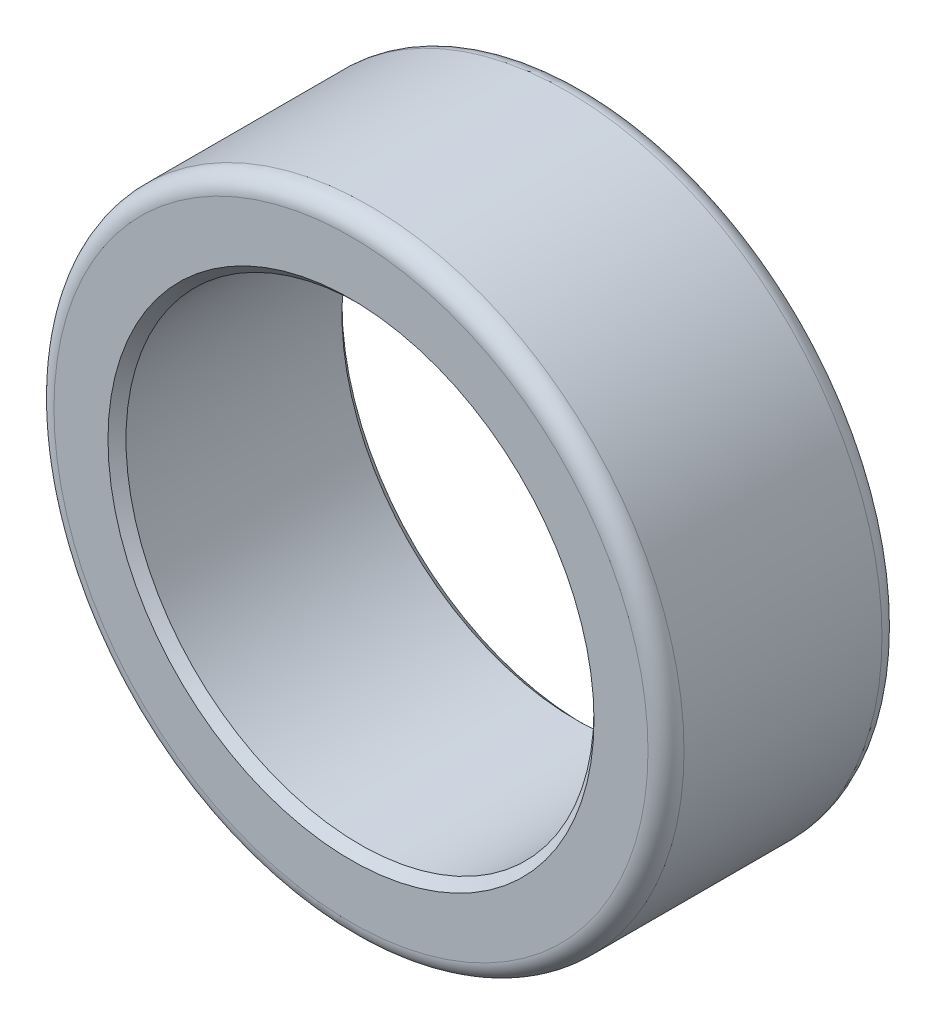
ISO-10303-21;
HEADER;
FILE_DESCRIPTION(('STEP AP214'),'2;1');
FILE_NAME('part.step','',(''),(''),'','','');
FILE_SCHEMA(('AUTOMOTIVE_DESIGN { 1 0 10303 214 1 1 1 1 }'));
ENDSEC;
DATA;
#1=APPLICATION_CONTEXT('core data for automotive mechanical design processes');
#2=APPLICATION_PROTOCOL_DEFINITION('international standard','automotive_design',2000,#1);
#3=PRODUCT_CONTEXT('',#1,'mechanical');
#4=PRODUCT('Part','Part','',(#3));
#5=PRODUCT_RELATED_PRODUCT_CATEGORY('part','',(#4));
#6=PRODUCT_DEFINITION_FORMATION('','',#4);
#7=PRODUCT_DEFINITION_CONTEXT('part definition',#1,'design');
#8=PRODUCT_DEFINITION('design','',#6,#7);
#9=PRODUCT_DEFINITION_SHAPE('','',#8);
#10=(LENGTH_UNIT() NAMED_UNIT(*) SI_UNIT(.MILLI.,.METRE.));
#11=(NAMED_UNIT(*) PLANE_ANGLE_UNIT() SI_UNIT($,.RADIAN.));
#12=(NAMED_UNIT(*) SI_UNIT($,.STERADIAN.) SOLID_ANGLE_UNIT());
#13=UNCERTAINTY_MEASURE_WITH_UNIT(LENGTH_MEASURE(1.E-05),#10,'distance_accuracy_value','');
#14=(GEOMETRIC_REPRESENTATION_CONTEXT(3) GLOBAL_UNCERTAINTY_ASSIGNED_CONTEXT((#13)) GLOBAL_UNIT_ASSIGNED_CONTEXT((#10,
#11,#12)) REPRESENTATION_CONTEXT('',''));
#15=CARTESIAN_POINT('',(0.,0.,0.));
#16=DIRECTION('',(0.,0.,1.));
#17=DIRECTION('',(1.,0.,0.));
#18=AXIS2_PLACEMENT_3D('',#15,#16,#17);
#19=CARTESIAN_POINT('',(0.,0.,-13.));
#20=DIRECTION('',(0.,0.,-1.));
#21=DIRECTION('',(-1.,0.,0.));
#22=AXIS2_PLACEMENT_3D('',#19,#20,#21);
#23=CONICAL_SURFACE('',#22,27.,0.785398163397449);
#24=CARTESIAN_POINT('',(0.,0.,-12.));
#25=DIRECTION('',(0.,0.,1.));
#26=DIRECTION('',(1.,0.,0.));
#27=AXIS2_PLACEMENT_3D('',#24,#25,#26);
#28=CIRCLE('',#27,26.);
#29=CARTESIAN_POINT('',(26.,0.,-12.));
#30=VERTEX_POINT('',#29);
#31=EDGE_CURVE('E60',#30,#30,#28,.T.);
#32=ORIENTED_EDGE('',*,*,#31,.T.);
#33=EDGE_LOOP('',(#32));
#34=FACE_BOUND('',#33,.T.);
#35=CARTESIAN_POINT('',(0.,0.,-13.));
#36=DIRECTION('',(0.,0.,1.));
#37=DIRECTION('',(1.,0.,0.));
#38=AXIS2_PLACEMENT_3D('',#35,#36,#37);
#39=CIRCLE('',#38,27.);
#40=CARTESIAN_POINT('',(27.,0.,-13.));
#41=VERTEX_POINT('',#40);
#42=EDGE_CURVE('E10',#41,#41,#39,.T.);
#43=ORIENTED_EDGE('',*,*,#42,.F.);
#44=EDGE_LOOP('',(#43));
#45=FACE_BOUND('',#44,.T.);
#46=ADVANCED_FACE('F32',(#34,#45),#23,.F.);
#47=CARTESIAN_POINT('',(27.,0.,-13.));
#48=DIRECTION('',(0.,0.,-1.));
#49=DIRECTION('',(-1.,0.,0.));
#50=AXIS2_PLACEMENT_3D('',#47,#48,#49);
#51=PLANE('',#50);
#52=ORIENTED_EDGE('',*,*,#42,.T.);
#53=EDGE_LOOP('',(#52));
#54=FACE_BOUND('',#53,.T.);
#55=CARTESIAN_POINT('',(0.,0.,-13.));
#56=DIRECTION('',(0.,0.,1.));
#57=DIRECTION('',(1.,0.,0.));
#58=AXIS2_PLACEMENT_3D('',#55,#56,#57);
#59=CIRCLE('',#58,33.);
#60=CARTESIAN_POINT('',(33.,0.,-13.));
#61=VERTEX_POINT('',#60);
#62=EDGE_CURVE('E38',#61,#61,#59,.T.);
#63=ORIENTED_EDGE('',*,*,#62,.F.);
#64=EDGE_LOOP('',(#63));
#65=FACE_BOUND('',#64,.T.);
#66=ADVANCED_FACE('F78',(#54,#65),#51,.T.);
#67=CARTESIAN_POINT('',(0.,0.,-11.));
#68=DIRECTION('',(0.,0.,1.));
#69=DIRECTION('',(1.,0.,0.));
#70=AXIS2_PLACEMENT_3D('',#67,#68,#69);
#71=TOROIDAL_SURFACE('',#70,33.,2.);
#72=ORIENTED_EDGE('',*,*,#62,.T.);
#73=EDGE_LOOP('',(#72));
#74=FACE_BOUND('',#73,.T.);
#75=CARTESIAN_POINT('',(0.,0.,-11.));
#76=DIRECTION('',(0.,0.,1.));
#77=DIRECTION('',(1.,0.,0.));
#78=AXIS2_PLACEMENT_3D('',#75,#76,#77);
#79=CIRCLE('',#78,35.);
#80=CARTESIAN_POINT('',(35.,0.,-11.));
#81=VERTEX_POINT('',#80);
#82=EDGE_CURVE('E42',#81,#81,#79,.T.);
#83=ORIENTED_EDGE('',*,*,#82,.F.);
#84=EDGE_LOOP('',(#83));
#85=FACE_BOUND('',#84,.T.);
#86=ADVANCED_FACE('F82',(#74,#85),#71,.T.);
#87=CARTESIAN_POINT('',(0.,0.,0.));
#88=DIRECTION('',(0.,0.,1.));
#89=DIRECTION('',(1.,0.,0.));
#90=AXIS2_PLACEMENT_3D('',#87,#88,#89);
#91=CYLINDRICAL_SURFACE('',#90,35.);
#92=ORIENTED_EDGE('',*,*,#82,.T.);
#93=EDGE_LOOP('',(#92));
#94=FACE_BOUND('',#93,.T.);
#95=CARTESIAN_POINT('',(0.,0.,11.));
#96=DIRECTION('',(0.,0.,1.));
#97=DIRECTION('',(1.,0.,0.));
#98=AXIS2_PLACEMENT_3D('',#95,#96,#97);
#99=CIRCLE('',#98,35.);
#100=CARTESIAN_POINT('',(35.,0.,11.));
#101=VERTEX_POINT('',#100);
#102=EDGE_CURVE('E46',#101,#101,#99,.T.);
#103=ORIENTED_EDGE('',*,*,#102,.F.);
#104=EDGE_LOOP('',(#103));
#105=FACE_BOUND('',#104,.T.);
#106=ADVANCED_FACE('F86',(#94,#105),#91,.T.);
#107=CARTESIAN_POINT('',(0.,0.,11.));
#108=DIRECTION('',(0.,0.,1.));
#109=DIRECTION('',(1.,0.,0.));
#110=AXIS2_PLACEMENT_3D('',#107,#108,#109);
#111=TOROIDAL_SURFACE('',#110,33.,2.00000000000001);
#112=ORIENTED_EDGE('',*,*,#102,.T.);
#113=EDGE_LOOP('',(#112));
#114=FACE_BOUND('',#113,.T.);
#115=CARTESIAN_POINT('',(0.,0.,13.));
#116=DIRECTION('',(0.,0.,1.));
#117=DIRECTION('',(1.,0.,0.));
#118=AXIS2_PLACEMENT_3D('',#115,#116,#117);
#119=CIRCLE('',#118,33.);
#120=CARTESIAN_POINT('',(33.,0.,13.));
#121=VERTEX_POINT('',#120);
#122=EDGE_CURVE('E51',#121,#121,#119,.T.);
#123=ORIENTED_EDGE('',*,*,#122,.F.);
#124=EDGE_LOOP('',(#123));
#125=FACE_BOUND('',#124,.T.);
#126=ADVANCED_FACE('F92',(#114,#125),#111,.T.);
#127=CARTESIAN_POINT('',(27.,0.,13.));
#128=DIRECTION('',(0.,0.,1.));
#129=DIRECTION('',(1.,0.,0.));
#130=AXIS2_PLACEMENT_3D('',#127,#128,#129);
#131=PLANE('',#130);
#132=ORIENTED_EDGE('',*,*,#122,.T.);
#133=EDGE_LOOP('',(#132));
#134=FACE_BOUND('',#133,.T.);
#135=CARTESIAN_POINT('',(0.,0.,13.));
#136=DIRECTION('',(0.,0.,1.));
#137=DIRECTION('',(1.,0.,0.));
#138=AXIS2_PLACEMENT_3D('',#135,#136,#137);
#139=CIRCLE('',#138,27.);
#140=CARTESIAN_POINT('',(27.,0.,13.));
#141=VERTEX_POINT('',#140);
#142=EDGE_CURVE('E54',#141,#141,#139,.T.);
#143=ORIENTED_EDGE('',*,*,#142,.F.);
#144=EDGE_LOOP('',(#143));
#145=FACE_BOUND('',#144,.T.);
#146=ADVANCED_FACE('F74',(#134,#145),#131,.T.);
#147=CARTESIAN_POINT('',(0.,0.,12.));
#148=DIRECTION('',(0.,0.,1.));
#149=DIRECTION('',(1.,0.,0.));
#150=AXIS2_PLACEMENT_3D('',#147,#148,#149);
#151=CONICAL_SURFACE('',#150,26.,0.785398163397442);
#152=ORIENTED_EDGE('',*,*,#142,.T.);
#153=EDGE_LOOP('',(#152));
#154=FACE_BOUND('',#153,.T.);
#155=CARTESIAN_POINT('',(0.,0.,12.));
#156=DIRECTION('',(0.,0.,1.));
#157=DIRECTION('',(1.,0.,0.));
#158=AXIS2_PLACEMENT_3D('',#155,#156,#157);
#159=CIRCLE('',#158,26.);
#160=CARTESIAN_POINT('',(26.,0.,12.));
#161=VERTEX_POINT('',#160);
#162=EDGE_CURVE('E57',#161,#161,#159,.T.);
#163=ORIENTED_EDGE('',*,*,#162,.F.);
#164=EDGE_LOOP('',(#163));
#165=FACE_BOUND('',#164,.T.);
#166=ADVANCED_FACE('F68',(#154,#165),#151,.F.);
#167=CARTESIAN_POINT('',(0.,0.,0.));
#168=DIRECTION('',(0.,0.,1.));
#169=DIRECTION('',(1.,0.,0.));
#170=AXIS2_PLACEMENT_3D('',#167,#168,#169);
#171=CYLINDRICAL_SURFACE('',#170,26.);
#172=ORIENTED_EDGE('',*,*,#162,.T.);
#173=EDGE_LOOP('',(#172));
#174=FACE_BOUND('',#173,.T.);
#175=ORIENTED_EDGE('',*,*,#31,.F.);
#176=EDGE_LOOP('',(#175));
#177=FACE_BOUND('',#176,.T.);
#178=ADVANCED_FACE('F66',(#174,#177),#171,.F.);
#179=CLOSED_SHELL('',(#46,#66,#86,#106,#126,#146,#166,#178));
#180=MANIFOLD_SOLID_BREP('B2',#179);
#181=ADVANCED_BREP_SHAPE_REPRESENTATION('',(#18,#180),#14);
#182=SHAPE_DEFINITION_REPRESENTATION(#9,#181);
ENDSEC;
END-ISO-10303-21;
